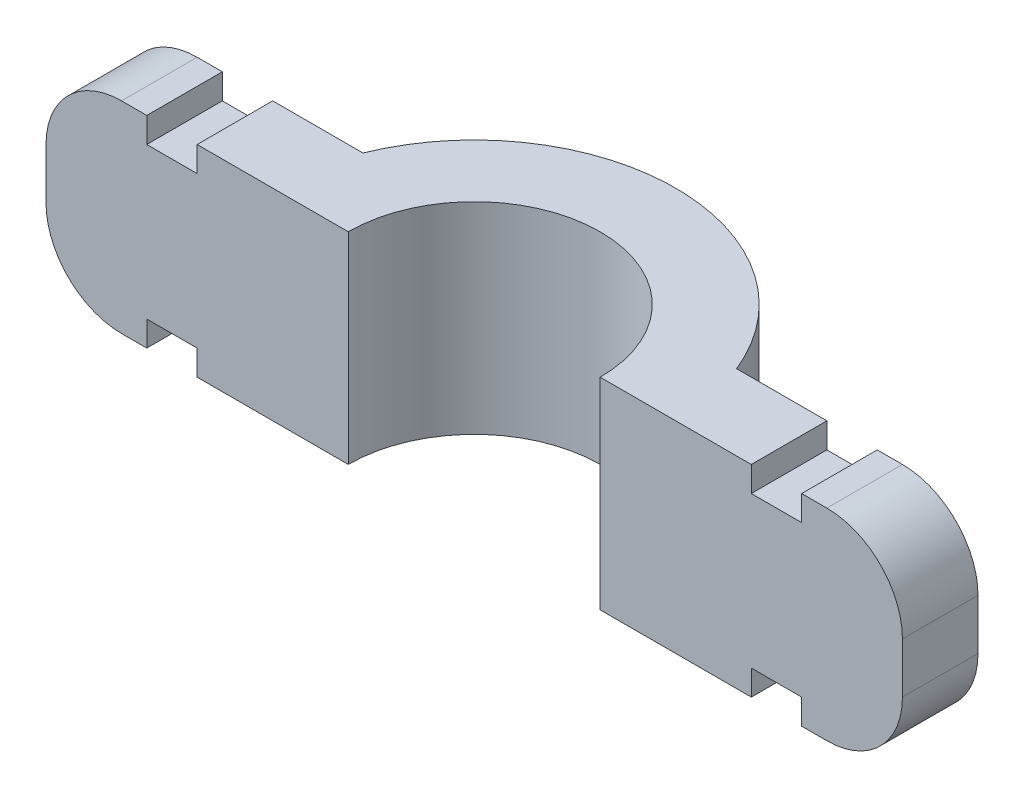
ISO-10303-21;
HEADER;
FILE_DESCRIPTION(('STEP AP214'),'2;1');
FILE_NAME('part.step','',(''),(''),'','','');
FILE_SCHEMA(('AUTOMOTIVE_DESIGN { 1 0 10303 214 1 1 1 1 }'));
ENDSEC;
DATA;
#1=APPLICATION_CONTEXT('core data for automotive mechanical design processes');
#2=APPLICATION_PROTOCOL_DEFINITION('international standard','automotive_design',2000,#1);
#3=PRODUCT_CONTEXT('',#1,'mechanical');
#4=PRODUCT('Part','Part','',(#3));
#5=PRODUCT_RELATED_PRODUCT_CATEGORY('part','',(#4));
#6=PRODUCT_DEFINITION_FORMATION('','',#4);
#7=PRODUCT_DEFINITION_CONTEXT('part definition',#1,'design');
#8=PRODUCT_DEFINITION('design','',#6,#7);
#9=PRODUCT_DEFINITION_SHAPE('','',#8);
#10=(LENGTH_UNIT() NAMED_UNIT(*) SI_UNIT(.MILLI.,.METRE.));
#11=(NAMED_UNIT(*) PLANE_ANGLE_UNIT() SI_UNIT($,.RADIAN.));
#12=(NAMED_UNIT(*) SI_UNIT($,.STERADIAN.) SOLID_ANGLE_UNIT());
#13=UNCERTAINTY_MEASURE_WITH_UNIT(LENGTH_MEASURE(1.E-05),#10,'distance_accuracy_value','');
#14=(GEOMETRIC_REPRESENTATION_CONTEXT(3) GLOBAL_UNCERTAINTY_ASSIGNED_CONTEXT((#13)) GLOBAL_UNIT_ASSIGNED_CONTEXT((#10,
#11,#12)) REPRESENTATION_CONTEXT('',''));
#15=CARTESIAN_POINT('',(0.,0.,0.));
#16=DIRECTION('',(0.,0.,1.));
#17=DIRECTION('',(1.,0.,0.));
#18=AXIS2_PLACEMENT_3D('',#15,#16,#17);
#19=CARTESIAN_POINT('',(5.,4.,0.));
#20=DIRECTION('',(0.,0.,-1.));
#21=DIRECTION('',(-1.,0.,0.));
#22=AXIS2_PLACEMENT_3D('',#19,#20,#21);
#23=PLANE('',#22);
#24=DIRECTION('',(1.,0.,0.));
#25=VECTOR('',#24,1.);
#26=CARTESIAN_POINT('',(5.,-4.,0.));
#27=LINE('',#26,#25);
#28=CARTESIAN_POINT('',(13.,-4.,0.));
#29=VERTEX_POINT('',#28);
#30=CARTESIAN_POINT('',(14.,-4.,0.));
#31=VERTEX_POINT('',#30);
#32=EDGE_CURVE('E417',#29,#31,#27,.T.);
#33=ORIENTED_EDGE('',*,*,#32,.T.);
#34=CARTESIAN_POINT('',(14.,-1.,0.));
#35=DIRECTION('',(0.,0.,-1.));
#36=DIRECTION('',(-1.,0.,0.));
#37=AXIS2_PLACEMENT_3D('',#34,#35,#36);
#38=CIRCLE('',#37,3.);
#39=CARTESIAN_POINT('',(17.,-1.,0.));
#40=VERTEX_POINT('',#39);
#41=EDGE_CURVE('E486',#31,#40,#38,.F.);
#42=ORIENTED_EDGE('',*,*,#41,.T.);
#43=DIRECTION('',(0.,-1.,0.));
#44=VECTOR('',#43,1.);
#45=CARTESIAN_POINT('',(17.,4.,0.));
#46=LINE('',#45,#44);
#47=CARTESIAN_POINT('',(17.,1.,0.));
#48=VERTEX_POINT('',#47);
#49=EDGE_CURVE('E459',#48,#40,#46,.T.);
#50=ORIENTED_EDGE('',*,*,#49,.F.);
#51=CARTESIAN_POINT('',(14.,1.,0.));
#52=DIRECTION('',(0.,0.,-1.));
#53=DIRECTION('',(-1.,0.,0.));
#54=AXIS2_PLACEMENT_3D('',#51,#52,#53);
#55=CIRCLE('',#54,3.);
#56=CARTESIAN_POINT('',(14.,4.,0.));
#57=VERTEX_POINT('',#56);
#58=EDGE_CURVE('E483',#48,#57,#55,.F.);
#59=ORIENTED_EDGE('',*,*,#58,.T.);
#60=DIRECTION('',(1.,0.,0.));
#61=VECTOR('',#60,1.);
#62=CARTESIAN_POINT('',(5.,4.,0.));
#63=LINE('',#62,#61);
#64=CARTESIAN_POINT('',(13.,4.,0.));
#65=VERTEX_POINT('',#64);
#66=EDGE_CURVE('E391',#65,#57,#63,.T.);
#67=ORIENTED_EDGE('',*,*,#66,.F.);
#68=DIRECTION('',(0.,1.,0.));
#69=VECTOR('',#68,1.);
#70=CARTESIAN_POINT('',(13.,3.,0.));
#71=LINE('',#70,#69);
#72=CARTESIAN_POINT('',(13.,3.,0.));
#73=VERTEX_POINT('',#72);
#74=EDGE_CURVE('E378',#73,#65,#71,.T.);
#75=ORIENTED_EDGE('',*,*,#74,.F.);
#76=DIRECTION('',(1.,0.,0.));
#77=VECTOR('',#76,1.);
#78=CARTESIAN_POINT('',(13.,3.,0.));
#79=LINE('',#78,#77);
#80=CARTESIAN_POINT('',(11.,3.,0.));
#81=VERTEX_POINT('',#80);
#82=EDGE_CURVE('E362',#81,#73,#79,.T.);
#83=ORIENTED_EDGE('',*,*,#82,.F.);
#84=DIRECTION('',(0.,1.,0.));
#85=VECTOR('',#84,1.);
#86=CARTESIAN_POINT('',(11.,3.,0.));
#87=LINE('',#86,#85);
#88=CARTESIAN_POINT('',(11.,4.,0.));
#89=VERTEX_POINT('',#88);
#90=EDGE_CURVE('E381',#81,#89,#87,.T.);
#91=ORIENTED_EDGE('',*,*,#90,.T.);
#92=CARTESIAN_POINT('',(5.,4.,0.));
#93=VERTEX_POINT('',#92);
#94=EDGE_CURVE('E393',#93,#89,#63,.T.);
#95=ORIENTED_EDGE('',*,*,#94,.F.);
#96=DIRECTION('',(0.,-1.,0.));
#97=VECTOR('',#96,1.);
#98=CARTESIAN_POINT('',(5.,4.,0.));
#99=LINE('',#98,#97);
#100=CARTESIAN_POINT('',(5.,-4.,0.));
#101=VERTEX_POINT('',#100);
#102=EDGE_CURVE('E463',#93,#101,#99,.T.);
#103=ORIENTED_EDGE('',*,*,#102,.T.);
#104=CARTESIAN_POINT('',(11.,-4.,0.));
#105=VERTEX_POINT('',#104);
#106=EDGE_CURVE('E418',#101,#105,#27,.T.);
#107=ORIENTED_EDGE('',*,*,#106,.T.);
#108=DIRECTION('',(0.,-1.,0.));
#109=VECTOR('',#108,1.);
#110=CARTESIAN_POINT('',(11.,-3.,0.));
#111=LINE('',#110,#109);
#112=CARTESIAN_POINT('',(11.,-3.,0.));
#113=VERTEX_POINT('',#112);
#114=EDGE_CURVE('E304',#113,#105,#111,.T.);
#115=ORIENTED_EDGE('',*,*,#114,.F.);
#116=DIRECTION('',(1.,0.,0.));
#117=VECTOR('',#116,1.);
#118=CARTESIAN_POINT('',(13.,-3.,0.));
#119=LINE('',#118,#117);
#120=CARTESIAN_POINT('',(13.,-3.,0.));
#121=VERTEX_POINT('',#120);
#122=EDGE_CURVE('E286',#113,#121,#119,.T.);
#123=ORIENTED_EDGE('',*,*,#122,.T.);
#124=DIRECTION('',(0.,-1.,0.));
#125=VECTOR('',#124,1.);
#126=CARTESIAN_POINT('',(13.,-3.,0.));
#127=LINE('',#126,#125);
#128=EDGE_CURVE('E307',#121,#29,#127,.T.);
#129=ORIENTED_EDGE('',*,*,#128,.T.);
#130=EDGE_LOOP('',(#33,#42,#50,#59,#67,#75,#83,#91,#95,#103,#107,#115,#123,#129));
#131=FACE_BOUND('',#130,.T.);
#132=ADVANCED_FACE('F39',(#131),#23,.F.);
#133=CARTESIAN_POINT('',(17.,4.,-3.));
#134=DIRECTION('',(0.,0.,1.));
#135=DIRECTION('',(1.,0.,0.));
#136=AXIS2_PLACEMENT_3D('',#133,#134,#135);
#137=PLANE('',#136);
#138=DIRECTION('',(0.,-1.,0.));
#139=VECTOR('',#138,1.);
#140=CARTESIAN_POINT('',(17.,4.,-3.));
#141=LINE('',#140,#139);
#142=CARTESIAN_POINT('',(17.,1.,-3.));
#143=VERTEX_POINT('',#142);
#144=CARTESIAN_POINT('',(17.,-1.,-3.));
#145=VERTEX_POINT('',#144);
#146=EDGE_CURVE('E455',#143,#145,#141,.T.);
#147=ORIENTED_EDGE('',*,*,#146,.T.);
#148=CARTESIAN_POINT('',(14.,-1.,-3.));
#149=DIRECTION('',(0.,0.,1.));
#150=DIRECTION('',(1.,0.,0.));
#151=AXIS2_PLACEMENT_3D('',#148,#149,#150);
#152=CIRCLE('',#151,3.);
#153=CARTESIAN_POINT('',(14.,-4.,-3.));
#154=VERTEX_POINT('',#153);
#155=EDGE_CURVE('E477',#145,#154,#152,.F.);
#156=ORIENTED_EDGE('',*,*,#155,.T.);
#157=DIRECTION('',(-1.,0.,0.));
#158=VECTOR('',#157,1.);
#159=CARTESIAN_POINT('',(17.,-4.,-3.));
#160=LINE('',#159,#158);
#161=CARTESIAN_POINT('',(13.,-4.,-3.));
#162=VERTEX_POINT('',#161);
#163=EDGE_CURVE('E423',#154,#162,#160,.T.);
#164=ORIENTED_EDGE('',*,*,#163,.T.);
#165=DIRECTION('',(0.,-1.,0.));
#166=VECTOR('',#165,1.);
#167=CARTESIAN_POINT('',(13.,-3.,-3.));
#168=LINE('',#167,#166);
#169=CARTESIAN_POINT('',(13.,-3.,-3.));
#170=VERTEX_POINT('',#169);
#171=EDGE_CURVE('E293',#170,#162,#168,.T.);
#172=ORIENTED_EDGE('',*,*,#171,.F.);
#173=DIRECTION('',(-1.,0.,0.));
#174=VECTOR('',#173,1.);
#175=CARTESIAN_POINT('',(13.,-3.,-3.));
#176=LINE('',#175,#174);
#177=CARTESIAN_POINT('',(11.,-3.,-3.));
#178=VERTEX_POINT('',#177);
#179=EDGE_CURVE('E278',#170,#178,#176,.T.);
#180=ORIENTED_EDGE('',*,*,#179,.T.);
#181=DIRECTION('',(0.,-1.,0.));
#182=VECTOR('',#181,1.);
#183=CARTESIAN_POINT('',(11.,-3.,-3.));
#184=LINE('',#183,#182);
#185=CARTESIAN_POINT('',(11.,-4.,-3.));
#186=VERTEX_POINT('',#185);
#187=EDGE_CURVE('E264',#178,#186,#184,.T.);
#188=ORIENTED_EDGE('',*,*,#187,.T.);
#189=CARTESIAN_POINT('',(7.41619848709566,-4.,-3.));
#190=VERTEX_POINT('',#189);
#191=EDGE_CURVE('E422',#186,#190,#160,.T.);
#192=ORIENTED_EDGE('',*,*,#191,.T.);
#193=DIRECTION('',(0.,-1.,0.));
#194=VECTOR('',#193,1.);
#195=CARTESIAN_POINT('',(7.41619848709566,4.,-3.));
#196=LINE('',#195,#194);
#197=CARTESIAN_POINT('',(7.41619848709566,4.,-3.));
#198=VERTEX_POINT('',#197);
#199=EDGE_CURVE('E451',#198,#190,#196,.T.);
#200=ORIENTED_EDGE('',*,*,#199,.F.);
#201=DIRECTION('',(-1.,0.,0.));
#202=VECTOR('',#201,1.);
#203=CARTESIAN_POINT('',(17.,4.,-3.));
#204=LINE('',#203,#202);
#205=CARTESIAN_POINT('',(11.,4.,-3.));
#206=VERTEX_POINT('',#205);
#207=EDGE_CURVE('E397',#206,#198,#204,.T.);
#208=ORIENTED_EDGE('',*,*,#207,.F.);
#209=DIRECTION('',(0.,1.,0.));
#210=VECTOR('',#209,1.);
#211=CARTESIAN_POINT('',(11.,3.,-3.));
#212=LINE('',#211,#210);
#213=CARTESIAN_POINT('',(11.,3.,-3.));
#214=VERTEX_POINT('',#213);
#215=EDGE_CURVE('E369',#214,#206,#212,.T.);
#216=ORIENTED_EDGE('',*,*,#215,.F.);
#217=DIRECTION('',(-1.,0.,0.));
#218=VECTOR('',#217,1.);
#219=CARTESIAN_POINT('',(13.,3.,-3.));
#220=LINE('',#219,#218);
#221=CARTESIAN_POINT('',(13.,3.,-3.));
#222=VERTEX_POINT('',#221);
#223=EDGE_CURVE('E353',#222,#214,#220,.T.);
#224=ORIENTED_EDGE('',*,*,#223,.F.);
#225=DIRECTION('',(0.,1.,0.));
#226=VECTOR('',#225,1.);
#227=CARTESIAN_POINT('',(13.,3.,-3.));
#228=LINE('',#227,#226);
#229=CARTESIAN_POINT('',(13.,4.,-3.));
#230=VERTEX_POINT('',#229);
#231=EDGE_CURVE('E336',#222,#230,#228,.T.);
#232=ORIENTED_EDGE('',*,*,#231,.T.);
#233=CARTESIAN_POINT('',(14.,4.,-3.));
#234=VERTEX_POINT('',#233);
#235=EDGE_CURVE('E398',#234,#230,#204,.T.);
#236=ORIENTED_EDGE('',*,*,#235,.F.);
#237=CARTESIAN_POINT('',(14.,1.,-3.));
#238=DIRECTION('',(0.,0.,1.));
#239=DIRECTION('',(1.,0.,0.));
#240=AXIS2_PLACEMENT_3D('',#237,#238,#239);
#241=CIRCLE('',#240,3.);
#242=EDGE_CURVE('E474',#234,#143,#241,.F.);
#243=ORIENTED_EDGE('',*,*,#242,.T.);
#244=EDGE_LOOP('',(#147,#156,#164,#172,#180,#188,#192,#200,#208,#216,#224,#232,#236,#243));
#245=FACE_BOUND('',#244,.T.);
#246=ADVANCED_FACE('F540',(#245),#137,.F.);
#247=CARTESIAN_POINT('',(-17.,4.,-3.));
#248=DIRECTION('',(0.,0.,1.));
#249=DIRECTION('',(1.,0.,0.));
#250=AXIS2_PLACEMENT_3D('',#247,#248,#249);
#251=PLANE('',#250);
#252=DIRECTION('',(-1.,0.,0.));
#253=VECTOR('',#252,1.);
#254=CARTESIAN_POINT('',(-17.,-4.,-3.));
#255=LINE('',#254,#253);
#256=CARTESIAN_POINT('',(-13.,-4.,-3.));
#257=VERTEX_POINT('',#256);
#258=CARTESIAN_POINT('',(-14.,-4.,-3.));
#259=VERTEX_POINT('',#258);
#260=EDGE_CURVE('E429',#257,#259,#255,.T.);
#261=ORIENTED_EDGE('',*,*,#260,.T.);
#262=CARTESIAN_POINT('',(-14.,-1.,-3.));
#263=DIRECTION('',(0.,0.,1.));
#264=DIRECTION('',(1.,0.,0.));
#265=AXIS2_PLACEMENT_3D('',#262,#263,#264);
#266=CIRCLE('',#265,3.);
#267=CARTESIAN_POINT('',(-17.,-1.,-3.));
#268=VERTEX_POINT('',#267);
#269=EDGE_CURVE('E48',#259,#268,#266,.F.);
#270=ORIENTED_EDGE('',*,*,#269,.T.);
#271=DIRECTION('',(0.,-1.,0.));
#272=VECTOR('',#271,1.);
#273=CARTESIAN_POINT('',(-17.,4.,-3.));
#274=LINE('',#273,#272);
#275=CARTESIAN_POINT('',(-17.,1.,-3.));
#276=VERTEX_POINT('',#275);
#277=EDGE_CURVE('E443',#276,#268,#274,.T.);
#278=ORIENTED_EDGE('',*,*,#277,.F.);
#279=CARTESIAN_POINT('',(-14.,1.,-3.));
#280=DIRECTION('',(0.,0.,1.));
#281=DIRECTION('',(1.,0.,0.));
#282=AXIS2_PLACEMENT_3D('',#279,#280,#281);
#283=CIRCLE('',#282,3.);
#284=CARTESIAN_POINT('',(-14.,4.,-3.));
#285=VERTEX_POINT('',#284);
#286=EDGE_CURVE('E55',#276,#285,#283,.F.);
#287=ORIENTED_EDGE('',*,*,#286,.T.);
#288=DIRECTION('',(-1.,0.,0.));
#289=VECTOR('',#288,1.);
#290=CARTESIAN_POINT('',(-17.,4.,-3.));
#291=LINE('',#290,#289);
#292=CARTESIAN_POINT('',(-13.,4.,-3.));
#293=VERTEX_POINT('',#292);
#294=EDGE_CURVE('E404',#293,#285,#291,.T.);
#295=ORIENTED_EDGE('',*,*,#294,.F.);
#296=DIRECTION('',(0.,1.,0.));
#297=VECTOR('',#296,1.);
#298=CARTESIAN_POINT('',(-13.,3.,-3.));
#299=LINE('',#298,#297);
#300=CARTESIAN_POINT('',(-13.,3.,-3.));
#301=VERTEX_POINT('',#300);
#302=EDGE_CURVE('E339',#301,#293,#299,.T.);
#303=ORIENTED_EDGE('',*,*,#302,.F.);
#304=DIRECTION('',(-1.,0.,0.));
#305=VECTOR('',#304,1.);
#306=CARTESIAN_POINT('',(-13.,3.,-3.));
#307=LINE('',#306,#305);
#308=CARTESIAN_POINT('',(-11.,3.,-3.));
#309=VERTEX_POINT('',#308);
#310=EDGE_CURVE('E327',#309,#301,#307,.T.);
#311=ORIENTED_EDGE('',*,*,#310,.F.);
#312=DIRECTION('',(0.,1.,0.));
#313=VECTOR('',#312,1.);
#314=CARTESIAN_POINT('',(-11.,3.,-3.));
#315=LINE('',#314,#313);
#316=CARTESIAN_POINT('',(-11.,4.,-3.));
#317=VERTEX_POINT('',#316);
#318=EDGE_CURVE('E343',#309,#317,#315,.T.);
#319=ORIENTED_EDGE('',*,*,#318,.T.);
#320=CARTESIAN_POINT('',(-7.41619848709566,4.,-3.));
#321=VERTEX_POINT('',#320);
#322=EDGE_CURVE('E405',#321,#317,#291,.T.);
#323=ORIENTED_EDGE('',*,*,#322,.F.);
#324=DIRECTION('',(0.,-1.,0.));
#325=VECTOR('',#324,1.);
#326=CARTESIAN_POINT('',(-7.41619848709566,4.,-3.));
#327=LINE('',#326,#325);
#328=CARTESIAN_POINT('',(-7.41619848709566,-4.,-3.));
#329=VERTEX_POINT('',#328);
#330=EDGE_CURVE('E447',#321,#329,#327,.T.);
#331=ORIENTED_EDGE('',*,*,#330,.T.);
#332=CARTESIAN_POINT('',(-11.,-4.,-3.));
#333=VERTEX_POINT('',#332);
#334=EDGE_CURVE('E430',#329,#333,#255,.T.);
#335=ORIENTED_EDGE('',*,*,#334,.T.);
#336=DIRECTION('',(0.,-1.,0.));
#337=VECTOR('',#336,1.);
#338=CARTESIAN_POINT('',(-11.,-3.,-3.));
#339=LINE('',#338,#337);
#340=CARTESIAN_POINT('',(-11.,-3.,-3.));
#341=VERTEX_POINT('',#340);
#342=EDGE_CURVE('E239',#341,#333,#339,.T.);
#343=ORIENTED_EDGE('',*,*,#342,.F.);
#344=DIRECTION('',(-1.,0.,0.));
#345=VECTOR('',#344,1.);
#346=CARTESIAN_POINT('',(-13.,-3.,-3.));
#347=LINE('',#346,#345);
#348=CARTESIAN_POINT('',(-13.,-3.,-3.));
#349=VERTEX_POINT('',#348);
#350=EDGE_CURVE('E246',#341,#349,#347,.T.);
#351=ORIENTED_EDGE('',*,*,#350,.T.);
#352=DIRECTION('',(0.,-1.,0.));
#353=VECTOR('',#352,1.);
#354=CARTESIAN_POINT('',(-13.,-3.,-3.));
#355=LINE('',#354,#353);
#356=EDGE_CURVE('E229',#349,#257,#355,.T.);
#357=ORIENTED_EDGE('',*,*,#356,.T.);
#358=EDGE_LOOP('',(#261,#270,#278,#287,#295,#303,#311,#319,#323,#331,#335,#343,#351,#357));
#359=FACE_BOUND('',#358,.T.);
#360=ADVANCED_FACE('F252',(#359),#251,.F.);
#361=CARTESIAN_POINT('',(-5.,4.,0.));
#362=DIRECTION('',(0.,0.,-1.));
#363=DIRECTION('',(-1.,0.,0.));
#364=AXIS2_PLACEMENT_3D('',#361,#362,#363);
#365=PLANE('',#364);
#366=DIRECTION('',(0.,-1.,0.));
#367=VECTOR('',#366,1.);
#368=CARTESIAN_POINT('',(-17.,4.,0.));
#369=LINE('',#368,#367);
#370=CARTESIAN_POINT('',(-17.,1.,0.));
#371=VERTEX_POINT('',#370);
#372=CARTESIAN_POINT('',(-17.,-1.,0.));
#373=VERTEX_POINT('',#372);
#374=EDGE_CURVE('E439',#371,#373,#369,.T.);
#375=ORIENTED_EDGE('',*,*,#374,.T.);
#376=CARTESIAN_POINT('',(-14.,-1.,0.));
#377=DIRECTION('',(0.,0.,-1.));
#378=DIRECTION('',(-1.,0.,0.));
#379=AXIS2_PLACEMENT_3D('',#376,#377,#378);
#380=CIRCLE('',#379,3.);
#381=CARTESIAN_POINT('',(-14.,-4.,0.));
#382=VERTEX_POINT('',#381);
#383=EDGE_CURVE('E503',#373,#382,#380,.F.);
#384=ORIENTED_EDGE('',*,*,#383,.T.);
#385=DIRECTION('',(1.,0.,0.));
#386=VECTOR('',#385,1.);
#387=CARTESIAN_POINT('',(-5.,-4.,0.));
#388=LINE('',#387,#386);
#389=CARTESIAN_POINT('',(-13.,-4.,0.));
#390=VERTEX_POINT('',#389);
#391=EDGE_CURVE('E392',#382,#390,#388,.T.);
#392=ORIENTED_EDGE('',*,*,#391,.T.);
#393=DIRECTION('',(0.,-1.,0.));
#394=VECTOR('',#393,1.);
#395=CARTESIAN_POINT('',(-13.,-3.,0.));
#396=LINE('',#395,#394);
#397=CARTESIAN_POINT('',(-13.,-3.,0.));
#398=VERTEX_POINT('',#397);
#399=EDGE_CURVE('E268',#398,#390,#396,.T.);
#400=ORIENTED_EDGE('',*,*,#399,.F.);
#401=DIRECTION('',(1.,0.,0.));
#402=VECTOR('',#401,1.);
#403=CARTESIAN_POINT('',(-13.,-3.,0.));
#404=LINE('',#403,#402);
#405=CARTESIAN_POINT('',(-11.,-3.,0.));
#406=VERTEX_POINT('',#405);
#407=EDGE_CURVE('E240',#398,#406,#404,.T.);
#408=ORIENTED_EDGE('',*,*,#407,.T.);
#409=DIRECTION('',(0.,-1.,0.));
#410=VECTOR('',#409,1.);
#411=CARTESIAN_POINT('',(-11.,-3.,0.));
#412=LINE('',#411,#410);
#413=CARTESIAN_POINT('',(-11.,-4.,0.));
#414=VERTEX_POINT('',#413);
#415=EDGE_CURVE('E272',#406,#414,#412,.T.);
#416=ORIENTED_EDGE('',*,*,#415,.T.);
#417=CARTESIAN_POINT('',(-5.,-4.,0.));
#418=VERTEX_POINT('',#417);
#419=EDGE_CURVE('E433',#414,#418,#388,.T.);
#420=ORIENTED_EDGE('',*,*,#419,.T.);
#421=DIRECTION('',(0.,-1.,0.));
#422=VECTOR('',#421,1.);
#423=CARTESIAN_POINT('',(-5.,4.,0.));
#424=LINE('',#423,#422);
#425=CARTESIAN_POINT('',(-5.,4.,0.));
#426=VERTEX_POINT('',#425);
#427=EDGE_CURVE('E413',#426,#418,#424,.T.);
#428=ORIENTED_EDGE('',*,*,#427,.F.);
#429=DIRECTION('',(1.,0.,0.));
#430=VECTOR('',#429,1.);
#431=CARTESIAN_POINT('',(-5.,4.,0.));
#432=LINE('',#431,#430);
#433=CARTESIAN_POINT('',(-11.,4.,0.));
#434=VERTEX_POINT('',#433);
#435=EDGE_CURVE('E409',#434,#426,#432,.T.);
#436=ORIENTED_EDGE('',*,*,#435,.F.);
#437=DIRECTION('',(0.,1.,0.));
#438=VECTOR('',#437,1.);
#439=CARTESIAN_POINT('',(-11.,3.,0.));
#440=LINE('',#439,#438);
#441=CARTESIAN_POINT('',(-11.,3.,0.));
#442=VERTEX_POINT('',#441);
#443=EDGE_CURVE('E347',#442,#434,#440,.T.);
#444=ORIENTED_EDGE('',*,*,#443,.F.);
#445=DIRECTION('',(1.,0.,0.));
#446=VECTOR('',#445,1.);
#447=CARTESIAN_POINT('',(-13.,3.,0.));
#448=LINE('',#447,#446);
#449=CARTESIAN_POINT('',(-13.,3.,0.));
#450=VERTEX_POINT('',#449);
#451=EDGE_CURVE('E318',#450,#442,#448,.T.);
#452=ORIENTED_EDGE('',*,*,#451,.F.);
#453=DIRECTION('',(0.,1.,0.));
#454=VECTOR('',#453,1.);
#455=CARTESIAN_POINT('',(-13.,3.,0.));
#456=LINE('',#455,#454);
#457=CARTESIAN_POINT('',(-13.,4.,0.));
#458=VERTEX_POINT('',#457);
#459=EDGE_CURVE('E331',#450,#458,#456,.T.);
#460=ORIENTED_EDGE('',*,*,#459,.T.);
#461=CARTESIAN_POINT('',(-14.,4.,0.));
#462=VERTEX_POINT('',#461);
#463=EDGE_CURVE('E410',#462,#458,#432,.T.);
#464=ORIENTED_EDGE('',*,*,#463,.F.);
#465=CARTESIAN_POINT('',(-14.,1.,0.));
#466=DIRECTION('',(0.,0.,-1.));
#467=DIRECTION('',(-1.,0.,0.));
#468=AXIS2_PLACEMENT_3D('',#465,#466,#467);
#469=CIRCLE('',#468,3.);
#470=EDGE_CURVE('E500',#462,#371,#469,.F.);
#471=ORIENTED_EDGE('',*,*,#470,.T.);
#472=EDGE_LOOP('',(#375,#384,#392,#400,#408,#416,#420,#428,#436,#444,#452,#460,#464,#471));
#473=FACE_BOUND('',#472,.T.);
#474=ADVANCED_FACE('F519',(#473),#365,.F.);
#475=CARTESIAN_POINT('',(0.,-4.,0.));
#476=DIRECTION('',(0.,1.,0.));
#477=DIRECTION('',(0.,0.,1.));
#478=AXIS2_PLACEMENT_3D('',#475,#476,#477);
#479=PLANE('',#478);
#480=ORIENTED_EDGE('',*,*,#391,.F.);
#481=DIRECTION('',(0.,0.,1.));
#482=VECTOR('',#481,1.);
#483=CARTESIAN_POINT('',(-14.,-4.,0.));
#484=LINE('',#483,#482);
#485=EDGE_CURVE('E63',#382,#259,#484,.F.);
#486=ORIENTED_EDGE('',*,*,#485,.T.);
#487=ORIENTED_EDGE('',*,*,#260,.F.);
#488=DIRECTION('',(0.,0.,1.));
#489=VECTOR('',#488,1.);
#490=CARTESIAN_POINT('',(-13.,-4.,-3.));
#491=LINE('',#490,#489);
#492=EDGE_CURVE('E236',#257,#390,#491,.T.);
#493=ORIENTED_EDGE('',*,*,#492,.T.);
#494=EDGE_LOOP('',(#480,#486,#487,#493));
#495=FACE_BOUND('',#494,.T.);
#496=ADVANCED_FACE('F520',(#495),#479,.F.);
#497=DIRECTION('',(0.,0.,-1.));
#498=VECTOR('',#497,1.);
#499=CARTESIAN_POINT('',(-11.,-4.,-3.));
#500=LINE('',#499,#498);
#501=EDGE_CURVE('E250',#414,#333,#500,.T.);
#502=ORIENTED_EDGE('',*,*,#501,.T.);
#503=ORIENTED_EDGE('',*,*,#334,.F.);
#504=CARTESIAN_POINT('',(0.,-4.,0.));
#505=DIRECTION('',(0.,1.,0.));
#506=DIRECTION('',(0.,0.,1.));
#507=AXIS2_PLACEMENT_3D('',#504,#505,#506);
#508=CIRCLE('',#507,8.);
#509=EDGE_CURVE('E426',#190,#329,#508,.T.);
#510=ORIENTED_EDGE('',*,*,#509,.F.);
#511=ORIENTED_EDGE('',*,*,#191,.F.);
#512=DIRECTION('',(0.,0.,1.));
#513=VECTOR('',#512,1.);
#514=CARTESIAN_POINT('',(11.,-4.,-3.));
#515=LINE('',#514,#513);
#516=EDGE_CURVE('E283',#186,#105,#515,.T.);
#517=ORIENTED_EDGE('',*,*,#516,.T.);
#518=ORIENTED_EDGE('',*,*,#106,.F.);
#519=CARTESIAN_POINT('',(0.,-4.,0.));
#520=DIRECTION('',(0.,-1.,0.));
#521=DIRECTION('',(0.,0.,1.));
#522=AXIS2_PLACEMENT_3D('',#519,#520,#521);
#523=CIRCLE('',#522,5.);
#524=EDGE_CURVE('E342',#418,#101,#523,.T.);
#525=ORIENTED_EDGE('',*,*,#524,.F.);
#526=ORIENTED_EDGE('',*,*,#419,.F.);
#527=EDGE_LOOP('',(#502,#503,#510,#511,#517,#518,#525,#526));
#528=FACE_BOUND('',#527,.T.);
#529=ADVANCED_FACE('F564',(#528),#479,.F.);
#530=ORIENTED_EDGE('',*,*,#163,.F.);
#531=DIRECTION('',(0.,0.,-1.));
#532=VECTOR('',#531,1.);
#533=CARTESIAN_POINT('',(14.,-4.,0.));
#534=LINE('',#533,#532);
#535=EDGE_CURVE('E480',#154,#31,#534,.F.);
#536=ORIENTED_EDGE('',*,*,#535,.T.);
#537=ORIENTED_EDGE('',*,*,#32,.F.);
#538=DIRECTION('',(0.,0.,-1.));
#539=VECTOR('',#538,1.);
#540=CARTESIAN_POINT('',(13.,-4.,-3.));
#541=LINE('',#540,#539);
#542=EDGE_CURVE('E294',#29,#162,#541,.T.);
#543=ORIENTED_EDGE('',*,*,#542,.T.);
#544=EDGE_LOOP('',(#530,#536,#537,#543));
#545=FACE_BOUND('',#544,.T.);
#546=ADVANCED_FACE('F721',(#545),#479,.F.);
#547=CARTESIAN_POINT('',(0.,4.,0.));
#548=DIRECTION('',(0.,1.,0.));
#549=DIRECTION('',(0.,0.,1.));
#550=AXIS2_PLACEMENT_3D('',#547,#548,#549);
#551=PLANE('',#550);
#552=ORIENTED_EDGE('',*,*,#294,.T.);
#553=DIRECTION('',(0.,0.,1.));
#554=VECTOR('',#553,1.);
#555=CARTESIAN_POINT('',(-14.,4.,0.));
#556=LINE('',#555,#554);
#557=EDGE_CURVE('E11',#285,#462,#556,.T.);
#558=ORIENTED_EDGE('',*,*,#557,.T.);
#559=ORIENTED_EDGE('',*,*,#463,.T.);
#560=DIRECTION('',(0.,0.,1.));
#561=VECTOR('',#560,1.);
#562=CARTESIAN_POINT('',(-13.,4.,-3.));
#563=LINE('',#562,#561);
#564=EDGE_CURVE('E332',#293,#458,#563,.T.);
#565=ORIENTED_EDGE('',*,*,#564,.F.);
#566=EDGE_LOOP('',(#552,#558,#559,#565));
#567=FACE_BOUND('',#566,.T.);
#568=ADVANCED_FACE('F597',(#567),#551,.T.);
#569=ORIENTED_EDGE('',*,*,#66,.T.);
#570=DIRECTION('',(0.,0.,-1.));
#571=VECTOR('',#570,1.);
#572=CARTESIAN_POINT('',(14.,4.,-3.));
#573=LINE('',#572,#571);
#574=EDGE_CURVE('E489',#57,#234,#573,.T.);
#575=ORIENTED_EDGE('',*,*,#574,.T.);
#576=ORIENTED_EDGE('',*,*,#235,.T.);
#577=DIRECTION('',(0.,0.,-1.));
#578=VECTOR('',#577,1.);
#579=CARTESIAN_POINT('',(13.,4.,-3.));
#580=LINE('',#579,#578);
#581=EDGE_CURVE('E358',#65,#230,#580,.T.);
#582=ORIENTED_EDGE('',*,*,#581,.F.);
#583=EDGE_LOOP('',(#569,#575,#576,#582));
#584=FACE_BOUND('',#583,.T.);
#585=ADVANCED_FACE('F549',(#584),#551,.T.);
#586=CARTESIAN_POINT('',(0.,4.,0.));
#587=DIRECTION('',(0.,-1.,0.));
#588=DIRECTION('',(0.,0.,-1.));
#589=AXIS2_PLACEMENT_3D('',#586,#587,#588);
#590=CYLINDRICAL_SURFACE('',#589,5.);
#591=ORIENTED_EDGE('',*,*,#524,.T.);
#592=ORIENTED_EDGE('',*,*,#102,.F.);
#593=CARTESIAN_POINT('',(0.,4.,0.));
#594=DIRECTION('',(0.,-1.,0.));
#595=DIRECTION('',(0.,0.,1.));
#596=AXIS2_PLACEMENT_3D('',#593,#594,#595);
#597=CIRCLE('',#596,5.);
#598=EDGE_CURVE('E387',#426,#93,#597,.T.);
#599=ORIENTED_EDGE('',*,*,#598,.F.);
#600=ORIENTED_EDGE('',*,*,#427,.T.);
#601=EDGE_LOOP('',(#591,#592,#599,#600));
#602=FACE_BOUND('',#601,.T.);
#603=ADVANCED_FACE('F562',(#602),#590,.F.);
#604=CARTESIAN_POINT('',(17.,4.,0.));
#605=DIRECTION('',(-1.,0.,0.));
#606=DIRECTION('',(0.,0.,1.));
#607=AXIS2_PLACEMENT_3D('',#604,#605,#606);
#608=PLANE('',#607);
#609=ORIENTED_EDGE('',*,*,#49,.T.);
#610=DIRECTION('',(0.,0.,-1.));
#611=VECTOR('',#610,1.);
#612=CARTESIAN_POINT('',(17.,-1.,0.));
#613=LINE('',#612,#611);
#614=EDGE_CURVE('E470',#40,#145,#613,.T.);
#615=ORIENTED_EDGE('',*,*,#614,.T.);
#616=ORIENTED_EDGE('',*,*,#146,.F.);
#617=DIRECTION('',(0.,0.,-1.));
#618=VECTOR('',#617,1.);
#619=CARTESIAN_POINT('',(17.,1.,0.));
#620=LINE('',#619,#618);
#621=EDGE_CURVE('E467',#143,#48,#620,.F.);
#622=ORIENTED_EDGE('',*,*,#621,.T.);
#623=EDGE_LOOP('',(#609,#615,#616,#622));
#624=FACE_BOUND('',#623,.T.);
#625=ADVANCED_FACE('F537',(#624),#608,.F.);
#626=CARTESIAN_POINT('',(0.,4.,0.));
#627=DIRECTION('',(0.,-1.,0.));
#628=DIRECTION('',(0.,0.,-1.));
#629=AXIS2_PLACEMENT_3D('',#626,#627,#628);
#630=CYLINDRICAL_SURFACE('',#629,8.);
#631=ORIENTED_EDGE('',*,*,#509,.T.);
#632=ORIENTED_EDGE('',*,*,#330,.F.);
#633=CARTESIAN_POINT('',(0.,4.,0.));
#634=DIRECTION('',(0.,1.,0.));
#635=DIRECTION('',(0.,0.,1.));
#636=AXIS2_PLACEMENT_3D('',#633,#634,#635);
#637=CIRCLE('',#636,8.);
#638=EDGE_CURVE('E401',#198,#321,#637,.T.);
#639=ORIENTED_EDGE('',*,*,#638,.F.);
#640=ORIENTED_EDGE('',*,*,#199,.T.);
#641=EDGE_LOOP('',(#631,#632,#639,#640));
#642=FACE_BOUND('',#641,.T.);
#643=ADVANCED_FACE('F582',(#642),#630,.T.);
#644=CARTESIAN_POINT('',(-17.,4.,0.));
#645=DIRECTION('',(1.,0.,0.));
#646=DIRECTION('',(0.,0.,-1.));
#647=AXIS2_PLACEMENT_3D('',#644,#645,#646);
#648=PLANE('',#647);
#649=ORIENTED_EDGE('',*,*,#277,.T.);
#650=DIRECTION('',(0.,0.,1.));
#651=VECTOR('',#650,1.);
#652=CARTESIAN_POINT('',(-17.,-1.,0.));
#653=LINE('',#652,#651);
#654=EDGE_CURVE('E496',#268,#373,#653,.T.);
#655=ORIENTED_EDGE('',*,*,#654,.T.);
#656=ORIENTED_EDGE('',*,*,#374,.F.);
#657=DIRECTION('',(0.,0.,1.));
#658=VECTOR('',#657,1.);
#659=CARTESIAN_POINT('',(-17.,1.,-3.));
#660=LINE('',#659,#658);
#661=EDGE_CURVE('E493',#371,#276,#660,.F.);
#662=ORIENTED_EDGE('',*,*,#661,.T.);
#663=EDGE_LOOP('',(#649,#655,#656,#662));
#664=FACE_BOUND('',#663,.T.);
#665=ADVANCED_FACE('F514',(#664),#648,.F.);
#666=DIRECTION('',(0.,0.,-1.));
#667=VECTOR('',#666,1.);
#668=CARTESIAN_POINT('',(-11.,4.,-3.));
#669=LINE('',#668,#667);
#670=EDGE_CURVE('E319',#434,#317,#669,.T.);
#671=ORIENTED_EDGE('',*,*,#670,.F.);
#672=ORIENTED_EDGE('',*,*,#435,.T.);
#673=ORIENTED_EDGE('',*,*,#598,.T.);
#674=ORIENTED_EDGE('',*,*,#94,.T.);
#675=DIRECTION('',(0.,0.,1.));
#676=VECTOR('',#675,1.);
#677=CARTESIAN_POINT('',(11.,4.,-3.));
#678=LINE('',#677,#676);
#679=EDGE_CURVE('E271',#206,#89,#678,.T.);
#680=ORIENTED_EDGE('',*,*,#679,.F.);
#681=ORIENTED_EDGE('',*,*,#207,.T.);
#682=ORIENTED_EDGE('',*,*,#638,.T.);
#683=ORIENTED_EDGE('',*,*,#322,.T.);
#684=EDGE_LOOP('',(#671,#672,#673,#674,#680,#681,#682,#683));
#685=FACE_BOUND('',#684,.T.);
#686=ADVANCED_FACE('F571',(#685),#551,.T.);
#687=CARTESIAN_POINT('',(13.,3.,-3.));
#688=DIRECTION('',(1.,0.,0.));
#689=DIRECTION('',(0.,0.,-1.));
#690=AXIS2_PLACEMENT_3D('',#687,#688,#689);
#691=PLANE('',#690);
#692=ORIENTED_EDGE('',*,*,#581,.T.);
#693=ORIENTED_EDGE('',*,*,#231,.F.);
#694=DIRECTION('',(0.,0.,-1.));
#695=VECTOR('',#694,1.);
#696=CARTESIAN_POINT('',(13.,3.,-3.));
#697=LINE('',#696,#695);
#698=EDGE_CURVE('E365',#73,#222,#697,.T.);
#699=ORIENTED_EDGE('',*,*,#698,.F.);
#700=ORIENTED_EDGE('',*,*,#74,.T.);
#701=EDGE_LOOP('',(#692,#693,#699,#700));
#702=FACE_BOUND('',#701,.T.);
#703=ADVANCED_FACE('F771',(#702),#691,.F.);
#704=CARTESIAN_POINT('',(11.,3.,-3.));
#705=DIRECTION('',(-1.,0.,0.));
#706=DIRECTION('',(0.,0.,1.));
#707=AXIS2_PLACEMENT_3D('',#704,#705,#706);
#708=PLANE('',#707);
#709=ORIENTED_EDGE('',*,*,#679,.T.);
#710=ORIENTED_EDGE('',*,*,#90,.F.);
#711=DIRECTION('',(0.,0.,1.));
#712=VECTOR('',#711,1.);
#713=CARTESIAN_POINT('',(11.,3.,-3.));
#714=LINE('',#713,#712);
#715=EDGE_CURVE('E357',#214,#81,#714,.T.);
#716=ORIENTED_EDGE('',*,*,#715,.F.);
#717=ORIENTED_EDGE('',*,*,#215,.T.);
#718=EDGE_LOOP('',(#709,#710,#716,#717));
#719=FACE_BOUND('',#718,.T.);
#720=ADVANCED_FACE('F762',(#719),#708,.F.);
#721=CARTESIAN_POINT('',(0.,3.,0.));
#722=DIRECTION('',(0.,1.,0.));
#723=DIRECTION('',(0.,0.,1.));
#724=AXIS2_PLACEMENT_3D('',#721,#722,#723);
#725=PLANE('',#724);
#726=ORIENTED_EDGE('',*,*,#223,.T.);
#727=ORIENTED_EDGE('',*,*,#715,.T.);
#728=ORIENTED_EDGE('',*,*,#82,.T.);
#729=ORIENTED_EDGE('',*,*,#698,.T.);
#730=EDGE_LOOP('',(#726,#727,#728,#729));
#731=FACE_BOUND('',#730,.T.);
#732=ADVANCED_FACE('F754',(#731),#725,.T.);
#733=CARTESIAN_POINT('',(-13.,3.,-3.));
#734=DIRECTION('',(-1.,0.,0.));
#735=DIRECTION('',(0.,0.,1.));
#736=AXIS2_PLACEMENT_3D('',#733,#734,#735);
#737=PLANE('',#736);
#738=ORIENTED_EDGE('',*,*,#564,.T.);
#739=ORIENTED_EDGE('',*,*,#459,.F.);
#740=DIRECTION('',(0.,0.,1.));
#741=VECTOR('',#740,1.);
#742=CARTESIAN_POINT('',(-13.,3.,-3.));
#743=LINE('',#742,#741);
#744=EDGE_CURVE('E314',#301,#450,#743,.T.);
#745=ORIENTED_EDGE('',*,*,#744,.F.);
#746=ORIENTED_EDGE('',*,*,#302,.T.);
#747=EDGE_LOOP('',(#738,#739,#745,#746));
#748=FACE_BOUND('',#747,.T.);
#749=ADVANCED_FACE('F594',(#748),#737,.F.);
#750=CARTESIAN_POINT('',(-11.,3.,-3.));
#751=DIRECTION('',(1.,0.,0.));
#752=DIRECTION('',(0.,0.,-1.));
#753=AXIS2_PLACEMENT_3D('',#750,#751,#752);
#754=PLANE('',#753);
#755=ORIENTED_EDGE('',*,*,#670,.T.);
#756=ORIENTED_EDGE('',*,*,#318,.F.);
#757=DIRECTION('',(0.,0.,-1.));
#758=VECTOR('',#757,1.);
#759=CARTESIAN_POINT('',(-11.,3.,-3.));
#760=LINE('',#759,#758);
#761=EDGE_CURVE('E323',#442,#309,#760,.T.);
#762=ORIENTED_EDGE('',*,*,#761,.F.);
#763=ORIENTED_EDGE('',*,*,#443,.T.);
#764=EDGE_LOOP('',(#755,#756,#762,#763));
#765=FACE_BOUND('',#764,.T.);
#766=ADVANCED_FACE('F588',(#765),#754,.F.);
#767=CARTESIAN_POINT('',(0.,3.,0.));
#768=DIRECTION('',(0.,1.,0.));
#769=DIRECTION('',(0.,0.,1.));
#770=AXIS2_PLACEMENT_3D('',#767,#768,#769);
#771=PLANE('',#770);
#772=ORIENTED_EDGE('',*,*,#744,.T.);
#773=ORIENTED_EDGE('',*,*,#451,.T.);
#774=ORIENTED_EDGE('',*,*,#761,.T.);
#775=ORIENTED_EDGE('',*,*,#310,.T.);
#776=EDGE_LOOP('',(#772,#773,#774,#775));
#777=FACE_BOUND('',#776,.T.);
#778=ADVANCED_FACE('F590',(#777),#771,.T.);
#779=CARTESIAN_POINT('',(11.,-3.,-3.));
#780=DIRECTION('',(1.,0.,0.));
#781=DIRECTION('',(0.,0.,-1.));
#782=AXIS2_PLACEMENT_3D('',#779,#780,#781);
#783=PLANE('',#782);
#784=ORIENTED_EDGE('',*,*,#516,.F.);
#785=ORIENTED_EDGE('',*,*,#187,.F.);
#786=DIRECTION('',(0.,0.,1.));
#787=VECTOR('',#786,1.);
#788=CARTESIAN_POINT('',(11.,-3.,-3.));
#789=LINE('',#788,#787);
#790=EDGE_CURVE('E290',#178,#113,#789,.T.);
#791=ORIENTED_EDGE('',*,*,#790,.T.);
#792=ORIENTED_EDGE('',*,*,#114,.T.);
#793=EDGE_LOOP('',(#784,#785,#791,#792));
#794=FACE_BOUND('',#793,.T.);
#795=ADVANCED_FACE('F679',(#794),#783,.T.);
#796=CARTESIAN_POINT('',(13.,-3.,-3.));
#797=DIRECTION('',(-1.,0.,0.));
#798=DIRECTION('',(0.,0.,1.));
#799=AXIS2_PLACEMENT_3D('',#796,#797,#798);
#800=PLANE('',#799);
#801=ORIENTED_EDGE('',*,*,#542,.F.);
#802=ORIENTED_EDGE('',*,*,#128,.F.);
#803=DIRECTION('',(0.,0.,-1.));
#804=VECTOR('',#803,1.);
#805=CARTESIAN_POINT('',(13.,-3.,-3.));
#806=LINE('',#805,#804);
#807=EDGE_CURVE('E282',#121,#170,#806,.T.);
#808=ORIENTED_EDGE('',*,*,#807,.T.);
#809=ORIENTED_EDGE('',*,*,#171,.T.);
#810=EDGE_LOOP('',(#801,#802,#808,#809));
#811=FACE_BOUND('',#810,.T.);
#812=ADVANCED_FACE('F670',(#811),#800,.T.);
#813=CARTESIAN_POINT('',(0.,-3.,0.));
#814=DIRECTION('',(0.,-1.,0.));
#815=DIRECTION('',(0.,0.,1.));
#816=AXIS2_PLACEMENT_3D('',#813,#814,#815);
#817=PLANE('',#816);
#818=ORIENTED_EDGE('',*,*,#179,.F.);
#819=ORIENTED_EDGE('',*,*,#807,.F.);
#820=ORIENTED_EDGE('',*,*,#122,.F.);
#821=ORIENTED_EDGE('',*,*,#790,.F.);
#822=EDGE_LOOP('',(#818,#819,#820,#821));
#823=FACE_BOUND('',#822,.T.);
#824=ADVANCED_FACE('F662',(#823),#817,.T.);
#825=CARTESIAN_POINT('',(-13.,-3.,-3.));
#826=DIRECTION('',(1.,0.,0.));
#827=DIRECTION('',(0.,0.,-1.));
#828=AXIS2_PLACEMENT_3D('',#825,#826,#827);
#829=PLANE('',#828);
#830=ORIENTED_EDGE('',*,*,#492,.F.);
#831=ORIENTED_EDGE('',*,*,#356,.F.);
#832=DIRECTION('',(0.,0.,1.));
#833=VECTOR('',#832,1.);
#834=CARTESIAN_POINT('',(-13.,-3.,-3.));
#835=LINE('',#834,#833);
#836=EDGE_CURVE('E233',#349,#398,#835,.T.);
#837=ORIENTED_EDGE('',*,*,#836,.T.);
#838=ORIENTED_EDGE('',*,*,#399,.T.);
#839=EDGE_LOOP('',(#830,#831,#837,#838));
#840=FACE_BOUND('',#839,.T.);
#841=ADVANCED_FACE('F231',(#840),#829,.T.);
#842=CARTESIAN_POINT('',(-11.,-3.,-3.));
#843=DIRECTION('',(-1.,0.,0.));
#844=DIRECTION('',(0.,0.,1.));
#845=AXIS2_PLACEMENT_3D('',#842,#843,#844);
#846=PLANE('',#845);
#847=ORIENTED_EDGE('',*,*,#501,.F.);
#848=ORIENTED_EDGE('',*,*,#415,.F.);
#849=DIRECTION('',(0.,0.,-1.));
#850=VECTOR('',#849,1.);
#851=CARTESIAN_POINT('',(-11.,-3.,-3.));
#852=LINE('',#851,#850);
#853=EDGE_CURVE('E255',#406,#341,#852,.T.);
#854=ORIENTED_EDGE('',*,*,#853,.T.);
#855=ORIENTED_EDGE('',*,*,#342,.T.);
#856=EDGE_LOOP('',(#847,#848,#854,#855));
#857=FACE_BOUND('',#856,.T.);
#858=ADVANCED_FACE('F646',(#857),#846,.T.);
#859=CARTESIAN_POINT('',(0.,-3.,0.));
#860=DIRECTION('',(0.,-1.,0.));
#861=DIRECTION('',(0.,0.,1.));
#862=AXIS2_PLACEMENT_3D('',#859,#860,#861);
#863=PLANE('',#862);
#864=ORIENTED_EDGE('',*,*,#836,.F.);
#865=ORIENTED_EDGE('',*,*,#350,.F.);
#866=ORIENTED_EDGE('',*,*,#853,.F.);
#867=ORIENTED_EDGE('',*,*,#407,.F.);
#868=EDGE_LOOP('',(#864,#865,#866,#867));
#869=FACE_BOUND('',#868,.T.);
#870=ADVANCED_FACE('F244',(#869),#863,.T.);
#871=CARTESIAN_POINT('',(14.,-1.,0.));
#872=DIRECTION('',(0.,0.,-1.));
#873=DIRECTION('',(-1.,0.,0.));
#874=AXIS2_PLACEMENT_3D('',#871,#872,#873);
#875=CYLINDRICAL_SURFACE('',#874,3.);
#876=ORIENTED_EDGE('',*,*,#41,.F.);
#877=ORIENTED_EDGE('',*,*,#535,.F.);
#878=ORIENTED_EDGE('',*,*,#155,.F.);
#879=ORIENTED_EDGE('',*,*,#614,.F.);
#880=EDGE_LOOP('',(#876,#877,#878,#879));
#881=FACE_BOUND('',#880,.T.);
#882=ADVANCED_FACE('F534',(#881),#875,.T.);
#883=CARTESIAN_POINT('',(14.,1.,0.));
#884=DIRECTION('',(0.,0.,1.));
#885=DIRECTION('',(1.,0.,0.));
#886=AXIS2_PLACEMENT_3D('',#883,#884,#885);
#887=CYLINDRICAL_SURFACE('',#886,3.);
#888=ORIENTED_EDGE('',*,*,#58,.F.);
#889=ORIENTED_EDGE('',*,*,#621,.F.);
#890=ORIENTED_EDGE('',*,*,#242,.F.);
#891=ORIENTED_EDGE('',*,*,#574,.F.);
#892=EDGE_LOOP('',(#888,#889,#890,#891));
#893=FACE_BOUND('',#892,.T.);
#894=ADVANCED_FACE('F546',(#893),#887,.T.);
#895=CARTESIAN_POINT('',(-14.,-1.,0.));
#896=DIRECTION('',(0.,0.,1.));
#897=DIRECTION('',(1.,0.,0.));
#898=AXIS2_PLACEMENT_3D('',#895,#896,#897);
#899=CYLINDRICAL_SURFACE('',#898,3.);
#900=ORIENTED_EDGE('',*,*,#269,.F.);
#901=ORIENTED_EDGE('',*,*,#485,.F.);
#902=ORIENTED_EDGE('',*,*,#383,.F.);
#903=ORIENTED_EDGE('',*,*,#654,.F.);
#904=EDGE_LOOP('',(#900,#901,#902,#903));
#905=FACE_BOUND('',#904,.T.);
#906=ADVANCED_FACE('F517',(#905),#899,.T.);
#907=CARTESIAN_POINT('',(-14.,1.,0.));
#908=DIRECTION('',(0.,0.,-1.));
#909=DIRECTION('',(-1.,0.,0.));
#910=AXIS2_PLACEMENT_3D('',#907,#908,#909);
#911=CYLINDRICAL_SURFACE('',#910,3.);
#912=ORIENTED_EDGE('',*,*,#286,.F.);
#913=ORIENTED_EDGE('',*,*,#661,.F.);
#914=ORIENTED_EDGE('',*,*,#470,.F.);
#915=ORIENTED_EDGE('',*,*,#557,.F.);
#916=EDGE_LOOP('',(#912,#913,#914,#915));
#917=FACE_BOUND('',#916,.T.);
#918=ADVANCED_FACE('F41',(#917),#911,.T.);
#919=CLOSED_SHELL('',(#132,#246,#360,#474,#496,#529,#546,#568,#585,#603,#625,#643,#665,#686,
#703,#720,#732,#749,#766,#778,#795,#812,#824,#841,#858,#870,#882,#894,#906,#918));
#920=MANIFOLD_SOLID_BREP('B2',#919);
#921=ADVANCED_BREP_SHAPE_REPRESENTATION('',(#18,#920),#14);
#922=SHAPE_DEFINITION_REPRESENTATION(#9,#921);
ENDSEC;
END-ISO-10303-21;
